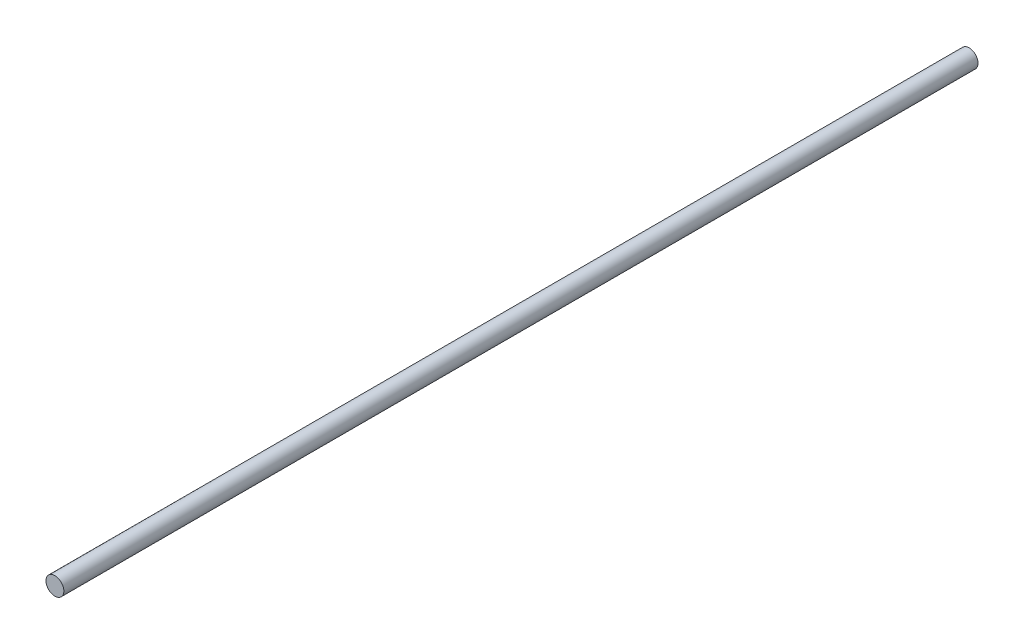
ISO-10303-21;
HEADER;
FILE_DESCRIPTION(('STEP AP214'),'2;1');
FILE_NAME('part.step','',(''),(''),'','','');
FILE_SCHEMA(('AUTOMOTIVE_DESIGN { 1 0 10303 214 1 1 1 1 }'));
ENDSEC;
DATA;
#1=APPLICATION_CONTEXT('core data for automotive mechanical design processes');
#2=APPLICATION_PROTOCOL_DEFINITION('international standard','automotive_design',2000,#1);
#3=PRODUCT_CONTEXT('',#1,'mechanical');
#4=PRODUCT('Part','Part','',(#3));
#5=PRODUCT_RELATED_PRODUCT_CATEGORY('part','',(#4));
#6=PRODUCT_DEFINITION_FORMATION('','',#4);
#7=PRODUCT_DEFINITION_CONTEXT('part definition',#1,'design');
#8=PRODUCT_DEFINITION('design','',#6,#7);
#9=PRODUCT_DEFINITION_SHAPE('','',#8);
#10=(LENGTH_UNIT() NAMED_UNIT(*) SI_UNIT(.MILLI.,.METRE.));
#11=(NAMED_UNIT(*) PLANE_ANGLE_UNIT() SI_UNIT($,.RADIAN.));
#12=(NAMED_UNIT(*) SI_UNIT($,.STERADIAN.) SOLID_ANGLE_UNIT());
#13=UNCERTAINTY_MEASURE_WITH_UNIT(LENGTH_MEASURE(1.E-05),#10,'distance_accuracy_value','');
#14=(GEOMETRIC_REPRESENTATION_CONTEXT(3) GLOBAL_UNCERTAINTY_ASSIGNED_CONTEXT((#13)) GLOBAL_UNIT_ASSIGNED_CONTEXT((#10,
#11,#12)) REPRESENTATION_CONTEXT('',''));
#15=CARTESIAN_POINT('',(0.,0.,0.));
#16=DIRECTION('',(0.,0.,1.));
#17=DIRECTION('',(1.,0.,0.));
#18=AXIS2_PLACEMENT_3D('',#15,#16,#17);
#19=CARTESIAN_POINT('',(0.,0.,205.));
#20=DIRECTION('',(0.,0.,-1.));
#21=DIRECTION('',(-1.,0.,0.));
#22=AXIS2_PLACEMENT_3D('',#19,#20,#21);
#23=CYLINDRICAL_SURFACE('',#22,4.);
#24=CARTESIAN_POINT('',(0.,0.,205.));
#25=DIRECTION('',(0.,0.,1.));
#26=DIRECTION('',(1.,0.,0.));
#27=AXIS2_PLACEMENT_3D('',#24,#25,#26);
#28=CIRCLE('',#27,4.);
#29=CARTESIAN_POINT('',(4.,0.,205.));
#30=VERTEX_POINT('',#29);
#31=EDGE_CURVE('E10',#30,#30,#28,.T.);
#32=ORIENTED_EDGE('',*,*,#31,.F.);
#33=EDGE_LOOP('',(#32));
#34=FACE_BOUND('',#33,.T.);
#35=CARTESIAN_POINT('',(0.,0.,-205.));
#36=DIRECTION('',(0.,0.,1.));
#37=DIRECTION('',(1.,0.,0.));
#38=AXIS2_PLACEMENT_3D('',#35,#36,#37);
#39=CIRCLE('',#38,4.);
#40=CARTESIAN_POINT('',(4.,0.,-205.));
#41=VERTEX_POINT('',#40);
#42=EDGE_CURVE('E38',#41,#41,#39,.T.);
#43=ORIENTED_EDGE('',*,*,#42,.T.);
#44=EDGE_LOOP('',(#43));
#45=FACE_BOUND('',#44,.T.);
#46=ADVANCED_FACE('F35',(#34,#45),#23,.T.);
#47=CARTESIAN_POINT('',(0.,0.,205.));
#48=DIRECTION('',(0.,0.,1.));
#49=DIRECTION('',(1.,0.,0.));
#50=AXIS2_PLACEMENT_3D('',#47,#48,#49);
#51=PLANE('',#50);
#52=ORIENTED_EDGE('',*,*,#31,.T.);
#53=EDGE_LOOP('',(#52));
#54=FACE_BOUND('',#53,.T.);
#55=ADVANCED_FACE('F50',(#54),#51,.T.);
#56=CARTESIAN_POINT('',(0.,0.,-205.));
#57=DIRECTION('',(0.,0.,1.));
#58=DIRECTION('',(1.,0.,0.));
#59=AXIS2_PLACEMENT_3D('',#56,#57,#58);
#60=PLANE('',#59);
#61=ORIENTED_EDGE('',*,*,#42,.F.);
#62=EDGE_LOOP('',(#61));
#63=FACE_BOUND('',#62,.T.);
#64=ADVANCED_FACE('F48',(#63),#60,.F.);
#65=CLOSED_SHELL('',(#46,#55,#64));
#66=MANIFOLD_SOLID_BREP('B2',#65);
#67=ADVANCED_BREP_SHAPE_REPRESENTATION('',(#18,#66),#14);
#68=SHAPE_DEFINITION_REPRESENTATION(#9,#67);
ENDSEC;
END-ISO-10303-21;
